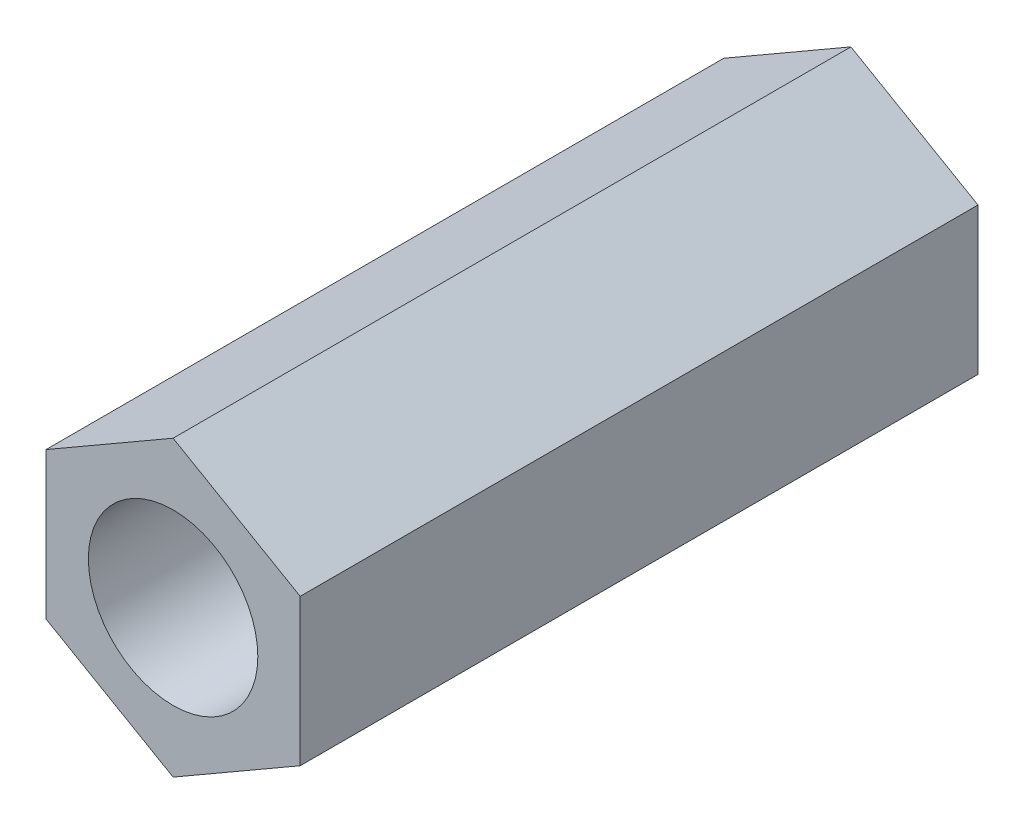
ISO-10303-21;
HEADER;
FILE_DESCRIPTION(('STEP AP214'),'2;1');
FILE_NAME('part.step','',(''),(''),'','','');
FILE_SCHEMA(('AUTOMOTIVE_DESIGN { 1 0 10303 214 1 1 1 1 }'));
ENDSEC;
DATA;
#1=APPLICATION_CONTEXT('core data for automotive mechanical design processes');
#2=APPLICATION_PROTOCOL_DEFINITION('international standard','automotive_design',2000,#1);
#3=PRODUCT_CONTEXT('',#1,'mechanical');
#4=PRODUCT('Part','Part','',(#3));
#5=PRODUCT_RELATED_PRODUCT_CATEGORY('part','',(#4));
#6=PRODUCT_DEFINITION_FORMATION('','',#4);
#7=PRODUCT_DEFINITION_CONTEXT('part definition',#1,'design');
#8=PRODUCT_DEFINITION('design','',#6,#7);
#9=PRODUCT_DEFINITION_SHAPE('','',#8);
#10=(LENGTH_UNIT() NAMED_UNIT(*) SI_UNIT(.MILLI.,.METRE.));
#11=(NAMED_UNIT(*) PLANE_ANGLE_UNIT() SI_UNIT($,.RADIAN.));
#12=(NAMED_UNIT(*) SI_UNIT($,.STERADIAN.) SOLID_ANGLE_UNIT());
#13=UNCERTAINTY_MEASURE_WITH_UNIT(LENGTH_MEASURE(1.E-05),#10,'distance_accuracy_value','');
#14=(GEOMETRIC_REPRESENTATION_CONTEXT(3) GLOBAL_UNCERTAINTY_ASSIGNED_CONTEXT((#13)) GLOBAL_UNIT_ASSIGNED_CONTEXT((#10,
#11,#12)) REPRESENTATION_CONTEXT('',''));
#15=CARTESIAN_POINT('',(0.,0.,0.));
#16=DIRECTION('',(0.,0.,1.));
#17=DIRECTION('',(1.,0.,0.));
#18=AXIS2_PLACEMENT_3D('',#15,#16,#17);
#19=CARTESIAN_POINT('',(0.,0.,76.2));
#20=DIRECTION('',(0.,0.,1.));
#21=DIRECTION('',(1.,0.,0.));
#22=AXIS2_PLACEMENT_3D('',#19,#20,#21);
#23=PLANE('',#22);
#24=DIRECTION('',(0.866025403784439,0.5,0.));
#25=VECTOR('',#24,1.);
#26=CARTESIAN_POINT('',(0.,-16.4977839420936,76.2));
#27=LINE('',#26,#25);
#28=CARTESIAN_POINT('',(0.,-16.4977839420936,76.2));
#29=VERTEX_POINT('',#28);
#30=CARTESIAN_POINT('',(14.2875,-8.24889197104677,76.2));
#31=VERTEX_POINT('',#30);
#32=EDGE_CURVE('E146',#29,#31,#27,.T.);
#33=ORIENTED_EDGE('',*,*,#32,.T.);
#34=DIRECTION('',(0.,1.,0.));
#35=VECTOR('',#34,1.);
#36=CARTESIAN_POINT('',(14.2875,-8.24889197104677,76.2));
#37=LINE('',#36,#35);
#38=CARTESIAN_POINT('',(14.2875,8.24889197104678,76.2));
#39=VERTEX_POINT('',#38);
#40=EDGE_CURVE('E94',#31,#39,#37,.T.);
#41=ORIENTED_EDGE('',*,*,#40,.T.);
#42=DIRECTION('',(-0.866025403784439,0.5,0.));
#43=VECTOR('',#42,1.);
#44=CARTESIAN_POINT('',(14.2875,8.24889197104678,76.2));
#45=LINE('',#44,#43);
#46=CARTESIAN_POINT('',(0.,16.4977839420936,76.2));
#47=VERTEX_POINT('',#46);
#48=EDGE_CURVE('E107',#39,#47,#45,.T.);
#49=ORIENTED_EDGE('',*,*,#48,.T.);
#50=DIRECTION('',(-0.866025403784439,-0.5,0.));
#51=VECTOR('',#50,1.);
#52=CARTESIAN_POINT('',(0.,16.4977839420936,76.2));
#53=LINE('',#52,#51);
#54=CARTESIAN_POINT('',(-14.2875,8.24889197104677,76.2));
#55=VERTEX_POINT('',#54);
#56=EDGE_CURVE('E101',#47,#55,#53,.T.);
#57=ORIENTED_EDGE('',*,*,#56,.T.);
#58=DIRECTION('',(0.,-1.,0.));
#59=VECTOR('',#58,1.);
#60=CARTESIAN_POINT('',(-14.2875,8.24889197104677,76.2));
#61=LINE('',#60,#59);
#62=CARTESIAN_POINT('',(-14.2875,-8.24889197104677,76.2));
#63=VERTEX_POINT('',#62);
#64=EDGE_CURVE('E105',#55,#63,#61,.T.);
#65=ORIENTED_EDGE('',*,*,#64,.T.);
#66=DIRECTION('',(0.866025403784439,-0.5,0.));
#67=VECTOR('',#66,1.);
#68=CARTESIAN_POINT('',(-14.2875,-8.24889197104677,76.2));
#69=LINE('',#68,#67);
#70=EDGE_CURVE('E57',#63,#29,#69,.T.);
#71=ORIENTED_EDGE('',*,*,#70,.T.);
#72=EDGE_LOOP('',(#33,#41,#49,#57,#65,#71));
#73=FACE_BOUND('',#72,.T.);
#74=CARTESIAN_POINT('',(0.,0.,76.2));
#75=DIRECTION('',(0.,0.,1.));
#76=DIRECTION('',(1.,0.,0.));
#77=AXIS2_PLACEMENT_3D('',#74,#75,#76);
#78=CIRCLE('',#77,9.525);
#79=CARTESIAN_POINT('',(9.525,0.,76.2));
#80=VERTEX_POINT('',#79);
#81=EDGE_CURVE('E134',#80,#80,#78,.T.);
#82=ORIENTED_EDGE('',*,*,#81,.F.);
#83=EDGE_LOOP('',(#82));
#84=FACE_BOUND('',#83,.T.);
#85=ADVANCED_FACE('F39',(#73,#84),#23,.T.);
#86=CARTESIAN_POINT('',(0.,0.,0.));
#87=DIRECTION('',(0.,0.,1.));
#88=DIRECTION('',(1.,0.,0.));
#89=AXIS2_PLACEMENT_3D('',#86,#87,#88);
#90=PLANE('',#89);
#91=DIRECTION('',(0.866025403784439,0.5,0.));
#92=VECTOR('',#91,1.);
#93=CARTESIAN_POINT('',(0.,-16.4977839420936,0.));
#94=LINE('',#93,#92);
#95=CARTESIAN_POINT('',(0.,-16.4977839420936,0.));
#96=VERTEX_POINT('',#95);
#97=CARTESIAN_POINT('',(14.2875,-8.24889197104677,0.));
#98=VERTEX_POINT('',#97);
#99=EDGE_CURVE('E129',#96,#98,#94,.T.);
#100=ORIENTED_EDGE('',*,*,#99,.F.);
#101=DIRECTION('',(0.866025403784439,-0.5,0.));
#102=VECTOR('',#101,1.);
#103=CARTESIAN_POINT('',(-14.2875,-8.24889197104677,0.));
#104=LINE('',#103,#102);
#105=CARTESIAN_POINT('',(-14.2875,-8.24889197104677,0.));
#106=VERTEX_POINT('',#105);
#107=EDGE_CURVE('E86',#106,#96,#104,.T.);
#108=ORIENTED_EDGE('',*,*,#107,.F.);
#109=DIRECTION('',(0.,-1.,0.));
#110=VECTOR('',#109,1.);
#111=CARTESIAN_POINT('',(-14.2875,8.24889197104677,0.));
#112=LINE('',#111,#110);
#113=CARTESIAN_POINT('',(-14.2875,8.24889197104677,0.));
#114=VERTEX_POINT('',#113);
#115=EDGE_CURVE('E80',#114,#106,#112,.T.);
#116=ORIENTED_EDGE('',*,*,#115,.F.);
#117=DIRECTION('',(-0.866025403784439,-0.5,0.));
#118=VECTOR('',#117,1.);
#119=CARTESIAN_POINT('',(0.,16.4977839420936,0.));
#120=LINE('',#119,#118);
#121=CARTESIAN_POINT('',(0.,16.4977839420936,0.));
#122=VERTEX_POINT('',#121);
#123=EDGE_CURVE('E116',#122,#114,#120,.T.);
#124=ORIENTED_EDGE('',*,*,#123,.F.);
#125=DIRECTION('',(-0.866025403784439,0.5,0.));
#126=VECTOR('',#125,1.);
#127=CARTESIAN_POINT('',(14.2875,8.24889197104678,0.));
#128=LINE('',#127,#126);
#129=CARTESIAN_POINT('',(14.2875,8.24889197104678,0.));
#130=VERTEX_POINT('',#129);
#131=EDGE_CURVE('E137',#130,#122,#128,.T.);
#132=ORIENTED_EDGE('',*,*,#131,.F.);
#133=DIRECTION('',(0.,1.,0.));
#134=VECTOR('',#133,1.);
#135=CARTESIAN_POINT('',(14.2875,-8.24889197104677,0.));
#136=LINE('',#135,#134);
#137=EDGE_CURVE('E133',#98,#130,#136,.T.);
#138=ORIENTED_EDGE('',*,*,#137,.F.);
#139=EDGE_LOOP('',(#100,#108,#116,#124,#132,#138));
#140=FACE_BOUND('',#139,.T.);
#141=CARTESIAN_POINT('',(0.,0.,0.));
#142=DIRECTION('',(0.,0.,1.));
#143=DIRECTION('',(1.,0.,0.));
#144=AXIS2_PLACEMENT_3D('',#141,#142,#143);
#145=CIRCLE('',#144,9.525);
#146=CARTESIAN_POINT('',(9.525,0.,0.));
#147=VERTEX_POINT('',#146);
#148=EDGE_CURVE('E243',#147,#147,#145,.T.);
#149=ORIENTED_EDGE('',*,*,#148,.T.);
#150=EDGE_LOOP('',(#149));
#151=FACE_BOUND('',#150,.T.);
#152=ADVANCED_FACE('F159',(#140,#151),#90,.F.);
#153=CARTESIAN_POINT('',(0.,-16.4977839420936,76.2));
#154=DIRECTION('',(-0.5,0.866025403784439,0.));
#155=DIRECTION('',(-0.866025403784438,-0.5,0.));
#156=AXIS2_PLACEMENT_3D('',#153,#154,#155);
#157=PLANE('',#156);
#158=ORIENTED_EDGE('',*,*,#99,.T.);
#159=DIRECTION('',(0.,0.,-1.));
#160=VECTOR('',#159,1.);
#161=CARTESIAN_POINT('',(14.2875,-8.24889197104677,76.2));
#162=LINE('',#161,#160);
#163=EDGE_CURVE('E11',#31,#98,#162,.T.);
#164=ORIENTED_EDGE('',*,*,#163,.F.);
#165=ORIENTED_EDGE('',*,*,#32,.F.);
#166=DIRECTION('',(0.,0.,-1.));
#167=VECTOR('',#166,1.);
#168=CARTESIAN_POINT('',(0.,-16.4977839420936,76.2));
#169=LINE('',#168,#167);
#170=EDGE_CURVE('E125',#29,#96,#169,.T.);
#171=ORIENTED_EDGE('',*,*,#170,.T.);
#172=EDGE_LOOP('',(#158,#164,#165,#171));
#173=FACE_BOUND('',#172,.T.);
#174=ADVANCED_FACE('F41',(#173),#157,.F.);
#175=CARTESIAN_POINT('',(14.2875,-8.24889197104677,76.2));
#176=DIRECTION('',(-1.,0.,0.));
#177=DIRECTION('',(0.,-1.,0.));
#178=AXIS2_PLACEMENT_3D('',#175,#176,#177);
#179=PLANE('',#178);
#180=ORIENTED_EDGE('',*,*,#137,.T.);
#181=DIRECTION('',(0.,0.,-1.));
#182=VECTOR('',#181,1.);
#183=CARTESIAN_POINT('',(14.2875,8.24889197104678,76.2));
#184=LINE('',#183,#182);
#185=EDGE_CURVE('E49',#39,#130,#184,.T.);
#186=ORIENTED_EDGE('',*,*,#185,.F.);
#187=ORIENTED_EDGE('',*,*,#40,.F.);
#188=ORIENTED_EDGE('',*,*,#163,.T.);
#189=EDGE_LOOP('',(#180,#186,#187,#188));
#190=FACE_BOUND('',#189,.T.);
#191=ADVANCED_FACE('F184',(#190),#179,.F.);
#192=CARTESIAN_POINT('',(14.2875,8.24889197104678,76.2));
#193=DIRECTION('',(-0.5,-0.866025403784439,0.));
#194=DIRECTION('',(0.866025403784439,-0.5,0.));
#195=AXIS2_PLACEMENT_3D('',#192,#193,#194);
#196=PLANE('',#195);
#197=ORIENTED_EDGE('',*,*,#131,.T.);
#198=DIRECTION('',(0.,0.,-1.));
#199=VECTOR('',#198,1.);
#200=CARTESIAN_POINT('',(0.,16.4977839420936,76.2));
#201=LINE('',#200,#199);
#202=EDGE_CURVE('E118',#47,#122,#201,.T.);
#203=ORIENTED_EDGE('',*,*,#202,.F.);
#204=ORIENTED_EDGE('',*,*,#48,.F.);
#205=ORIENTED_EDGE('',*,*,#185,.T.);
#206=EDGE_LOOP('',(#197,#203,#204,#205));
#207=FACE_BOUND('',#206,.T.);
#208=ADVANCED_FACE('F156',(#207),#196,.F.);
#209=CARTESIAN_POINT('',(0.,16.4977839420936,76.2));
#210=DIRECTION('',(0.5,-0.866025403784439,0.));
#211=DIRECTION('',(0.866025403784439,0.5,0.));
#212=AXIS2_PLACEMENT_3D('',#209,#210,#211);
#213=PLANE('',#212);
#214=ORIENTED_EDGE('',*,*,#123,.T.);
#215=DIRECTION('',(0.,0.,-1.));
#216=VECTOR('',#215,1.);
#217=CARTESIAN_POINT('',(-14.2875,8.24889197104677,76.2));
#218=LINE('',#217,#216);
#219=EDGE_CURVE('E113',#55,#114,#218,.T.);
#220=ORIENTED_EDGE('',*,*,#219,.F.);
#221=ORIENTED_EDGE('',*,*,#56,.F.);
#222=ORIENTED_EDGE('',*,*,#202,.T.);
#223=EDGE_LOOP('',(#214,#220,#221,#222));
#224=FACE_BOUND('',#223,.T.);
#225=ADVANCED_FACE('F114',(#224),#213,.F.);
#226=CARTESIAN_POINT('',(-14.2875,8.24889197104677,76.2));
#227=DIRECTION('',(1.,0.,0.));
#228=DIRECTION('',(0.,1.,0.));
#229=AXIS2_PLACEMENT_3D('',#226,#227,#228);
#230=PLANE('',#229);
#231=ORIENTED_EDGE('',*,*,#115,.T.);
#232=DIRECTION('',(0.,0.,-1.));
#233=VECTOR('',#232,1.);
#234=CARTESIAN_POINT('',(-14.2875,-8.24889197104677,76.2));
#235=LINE('',#234,#233);
#236=EDGE_CURVE('E119',#63,#106,#235,.T.);
#237=ORIENTED_EDGE('',*,*,#236,.F.);
#238=ORIENTED_EDGE('',*,*,#64,.F.);
#239=ORIENTED_EDGE('',*,*,#219,.T.);
#240=EDGE_LOOP('',(#231,#237,#238,#239));
#241=FACE_BOUND('',#240,.T.);
#242=ADVANCED_FACE('F121',(#241),#230,.F.);
#243=CARTESIAN_POINT('',(-14.2875,-8.24889197104677,76.2));
#244=DIRECTION('',(0.5,0.866025403784438,0.));
#245=DIRECTION('',(-0.866025403784438,0.5,0.));
#246=AXIS2_PLACEMENT_3D('',#243,#244,#245);
#247=PLANE('',#246);
#248=ORIENTED_EDGE('',*,*,#107,.T.);
#249=ORIENTED_EDGE('',*,*,#170,.F.);
#250=ORIENTED_EDGE('',*,*,#70,.F.);
#251=ORIENTED_EDGE('',*,*,#236,.T.);
#252=EDGE_LOOP('',(#248,#249,#250,#251));
#253=FACE_BOUND('',#252,.T.);
#254=ADVANCED_FACE('F164',(#253),#247,.F.);
#255=CARTESIAN_POINT('',(0.,0.,76.2));
#256=DIRECTION('',(0.,0.,-1.));
#257=DIRECTION('',(-1.,0.,0.));
#258=AXIS2_PLACEMENT_3D('',#255,#256,#257);
#259=CYLINDRICAL_SURFACE('',#258,9.525);
#260=ORIENTED_EDGE('',*,*,#81,.T.);
#261=EDGE_LOOP('',(#260));
#262=FACE_BOUND('',#261,.T.);
#263=ORIENTED_EDGE('',*,*,#148,.F.);
#264=EDGE_LOOP('',(#263));
#265=FACE_BOUND('',#264,.T.);
#266=ADVANCED_FACE('F166',(#262,#265),#259,.F.);
#267=CLOSED_SHELL('',(#85,#152,#174,#191,#208,#225,#242,#254,#266));
#268=MANIFOLD_SOLID_BREP('B2',#267);
#269=ADVANCED_BREP_SHAPE_REPRESENTATION('',(#18,#268),#14);
#270=SHAPE_DEFINITION_REPRESENTATION(#9,#269);
ENDSEC;
END-ISO-10303-21;
